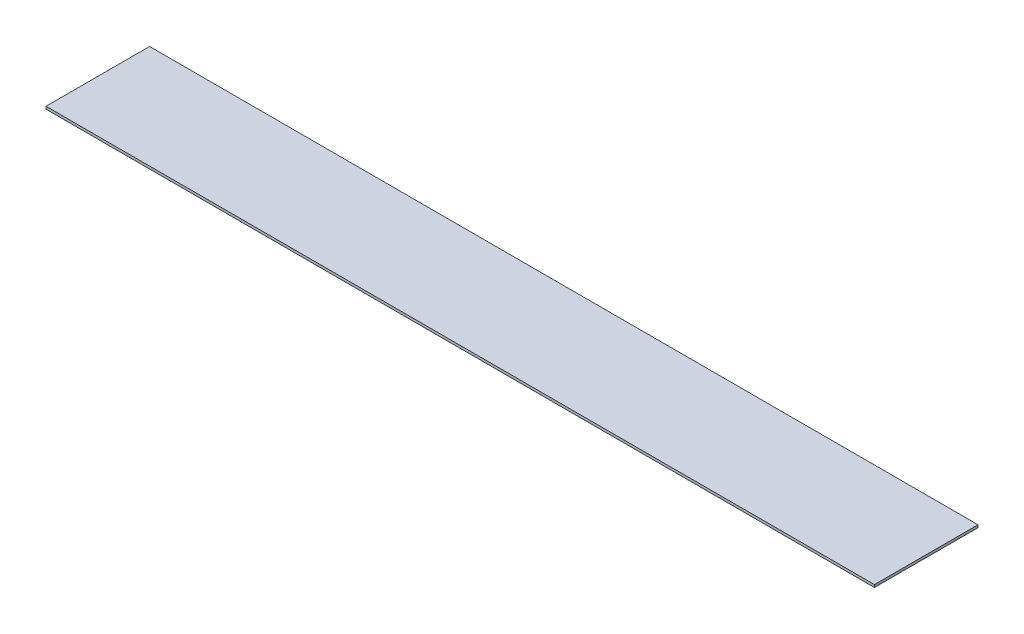
ISO-10303-21;
HEADER;
FILE_DESCRIPTION(('STEP AP214'),'2;1');
FILE_NAME('part.step','',(''),(''),'','','');
FILE_SCHEMA(('AUTOMOTIVE_DESIGN { 1 0 10303 214 1 1 1 1 }'));
ENDSEC;
DATA;
#1=APPLICATION_CONTEXT('core data for automotive mechanical design processes');
#2=APPLICATION_PROTOCOL_DEFINITION('international standard','automotive_design',2000,#1);
#3=PRODUCT_CONTEXT('',#1,'mechanical');
#4=PRODUCT('Part','Part','',(#3));
#5=PRODUCT_RELATED_PRODUCT_CATEGORY('part','',(#4));
#6=PRODUCT_DEFINITION_FORMATION('','',#4);
#7=PRODUCT_DEFINITION_CONTEXT('part definition',#1,'design');
#8=PRODUCT_DEFINITION('design','',#6,#7);
#9=PRODUCT_DEFINITION_SHAPE('','',#8);
#10=(LENGTH_UNIT() NAMED_UNIT(*) SI_UNIT(.MILLI.,.METRE.));
#11=(NAMED_UNIT(*) PLANE_ANGLE_UNIT() SI_UNIT($,.RADIAN.));
#12=(NAMED_UNIT(*) SI_UNIT($,.STERADIAN.) SOLID_ANGLE_UNIT());
#13=UNCERTAINTY_MEASURE_WITH_UNIT(LENGTH_MEASURE(1.E-05),#10,'distance_accuracy_value','');
#14=(GEOMETRIC_REPRESENTATION_CONTEXT(3) GLOBAL_UNCERTAINTY_ASSIGNED_CONTEXT((#13)) GLOBAL_UNIT_ASSIGNED_CONTEXT((#10,
#11,#12)) REPRESENTATION_CONTEXT('',''));
#15=CARTESIAN_POINT('',(0.,0.,0.));
#16=DIRECTION('',(0.,0.,1.));
#17=DIRECTION('',(1.,0.,0.));
#18=AXIS2_PLACEMENT_3D('',#15,#16,#17);
#19=CARTESIAN_POINT('',(0.,1.27,0.));
#20=DIRECTION('',(1.,0.,0.));
#21=DIRECTION('',(0.,0.,-1.));
#22=AXIS2_PLACEMENT_3D('',#19,#20,#21);
#23=PLANE('',#22);
#24=DIRECTION('',(0.,0.,1.));
#25=VECTOR('',#24,1.);
#26=CARTESIAN_POINT('',(0.,0.,0.));
#27=LINE('',#26,#25);
#28=CARTESIAN_POINT('',(0.,0.,-50.8));
#29=VERTEX_POINT('',#28);
#30=CARTESIAN_POINT('',(0.,0.,0.));
#31=VERTEX_POINT('',#30);
#32=EDGE_CURVE('E95',#29,#31,#27,.T.);
#33=ORIENTED_EDGE('',*,*,#32,.T.);
#34=DIRECTION('',(0.,-1.,0.));
#35=VECTOR('',#34,1.);
#36=CARTESIAN_POINT('',(0.,1.27,0.));
#37=LINE('',#36,#35);
#38=CARTESIAN_POINT('',(0.,1.27,0.));
#39=VERTEX_POINT('',#38);
#40=EDGE_CURVE('E11',#39,#31,#37,.T.);
#41=ORIENTED_EDGE('',*,*,#40,.F.);
#42=DIRECTION('',(0.,0.,1.));
#43=VECTOR('',#42,1.);
#44=CARTESIAN_POINT('',(0.,1.27,0.));
#45=LINE('',#44,#43);
#46=CARTESIAN_POINT('',(0.,1.27,-50.8));
#47=VERTEX_POINT('',#46);
#48=EDGE_CURVE('E83',#47,#39,#45,.T.);
#49=ORIENTED_EDGE('',*,*,#48,.F.);
#50=DIRECTION('',(0.,-1.,0.));
#51=VECTOR('',#50,1.);
#52=CARTESIAN_POINT('',(0.,1.27,-50.8));
#53=LINE('',#52,#51);
#54=EDGE_CURVE('E91',#47,#29,#53,.T.);
#55=ORIENTED_EDGE('',*,*,#54,.T.);
#56=EDGE_LOOP('',(#33,#41,#49,#55));
#57=FACE_BOUND('',#56,.T.);
#58=ADVANCED_FACE('F32',(#57),#23,.F.);
#59=CARTESIAN_POINT('',(0.,1.27,0.));
#60=DIRECTION('',(0.,0.,-1.));
#61=DIRECTION('',(-1.,0.,0.));
#62=AXIS2_PLACEMENT_3D('',#59,#60,#61);
#63=PLANE('',#62);
#64=DIRECTION('',(1.,0.,0.));
#65=VECTOR('',#64,1.);
#66=CARTESIAN_POINT('',(0.,0.,0.));
#67=LINE('',#66,#65);
#68=CARTESIAN_POINT('',(406.4,0.,0.));
#69=VERTEX_POINT('',#68);
#70=EDGE_CURVE('E87',#31,#69,#67,.T.);
#71=ORIENTED_EDGE('',*,*,#70,.T.);
#72=DIRECTION('',(0.,-1.,0.));
#73=VECTOR('',#72,1.);
#74=CARTESIAN_POINT('',(406.4,1.27,0.));
#75=LINE('',#74,#73);
#76=CARTESIAN_POINT('',(406.4,1.27,0.));
#77=VERTEX_POINT('',#76);
#78=EDGE_CURVE('E40',#77,#69,#75,.T.);
#79=ORIENTED_EDGE('',*,*,#78,.F.);
#80=DIRECTION('',(1.,0.,0.));
#81=VECTOR('',#80,1.);
#82=CARTESIAN_POINT('',(0.,1.27,0.));
#83=LINE('',#82,#81);
#84=EDGE_CURVE('E78',#39,#77,#83,.T.);
#85=ORIENTED_EDGE('',*,*,#84,.F.);
#86=ORIENTED_EDGE('',*,*,#40,.T.);
#87=EDGE_LOOP('',(#71,#79,#85,#86));
#88=FACE_BOUND('',#87,.T.);
#89=ADVANCED_FACE('F86',(#88),#63,.F.);
#90=CARTESIAN_POINT('',(406.4,1.27,0.));
#91=DIRECTION('',(-1.,0.,0.));
#92=DIRECTION('',(0.,0.,1.));
#93=AXIS2_PLACEMENT_3D('',#90,#91,#92);
#94=PLANE('',#93);
#95=DIRECTION('',(0.,0.,-1.));
#96=VECTOR('',#95,1.);
#97=CARTESIAN_POINT('',(406.4,0.,0.));
#98=LINE('',#97,#96);
#99=CARTESIAN_POINT('',(406.4,0.,-50.8));
#100=VERTEX_POINT('',#99);
#101=EDGE_CURVE('E65',#69,#100,#98,.T.);
#102=ORIENTED_EDGE('',*,*,#101,.T.);
#103=DIRECTION('',(0.,-1.,0.));
#104=VECTOR('',#103,1.);
#105=CARTESIAN_POINT('',(406.4,1.27,-50.8));
#106=LINE('',#105,#104);
#107=CARTESIAN_POINT('',(406.4,1.27,-50.8));
#108=VERTEX_POINT('',#107);
#109=EDGE_CURVE('E88',#108,#100,#106,.T.);
#110=ORIENTED_EDGE('',*,*,#109,.F.);
#111=DIRECTION('',(0.,0.,-1.));
#112=VECTOR('',#111,1.);
#113=CARTESIAN_POINT('',(406.4,1.27,0.));
#114=LINE('',#113,#112);
#115=EDGE_CURVE('E81',#77,#108,#114,.T.);
#116=ORIENTED_EDGE('',*,*,#115,.F.);
#117=ORIENTED_EDGE('',*,*,#78,.T.);
#118=EDGE_LOOP('',(#102,#110,#116,#117));
#119=FACE_BOUND('',#118,.T.);
#120=ADVANCED_FACE('F89',(#119),#94,.F.);
#121=CARTESIAN_POINT('',(0.,1.27,-50.8));
#122=DIRECTION('',(0.,0.,1.));
#123=DIRECTION('',(1.,0.,0.));
#124=AXIS2_PLACEMENT_3D('',#121,#122,#123);
#125=PLANE('',#124);
#126=DIRECTION('',(-1.,0.,0.));
#127=VECTOR('',#126,1.);
#128=CARTESIAN_POINT('',(0.,0.,-50.8));
#129=LINE('',#128,#127);
#130=EDGE_CURVE('E71',#100,#29,#129,.T.);
#131=ORIENTED_EDGE('',*,*,#130,.T.);
#132=ORIENTED_EDGE('',*,*,#54,.F.);
#133=DIRECTION('',(-1.,0.,0.));
#134=VECTOR('',#133,1.);
#135=CARTESIAN_POINT('',(0.,1.27,-50.8));
#136=LINE('',#135,#134);
#137=EDGE_CURVE('E48',#108,#47,#136,.T.);
#138=ORIENTED_EDGE('',*,*,#137,.F.);
#139=ORIENTED_EDGE('',*,*,#109,.T.);
#140=EDGE_LOOP('',(#131,#132,#138,#139));
#141=FACE_BOUND('',#140,.T.);
#142=ADVANCED_FACE('F102',(#141),#125,.F.);
#143=CARTESIAN_POINT('',(0.,1.27,0.));
#144=DIRECTION('',(0.,-1.,0.));
#145=DIRECTION('',(0.,0.,-1.));
#146=AXIS2_PLACEMENT_3D('',#143,#144,#145);
#147=PLANE('',#146);
#148=ORIENTED_EDGE('',*,*,#48,.T.);
#149=ORIENTED_EDGE('',*,*,#84,.T.);
#150=ORIENTED_EDGE('',*,*,#115,.T.);
#151=ORIENTED_EDGE('',*,*,#137,.T.);
#152=EDGE_LOOP('',(#148,#149,#150,#151));
#153=FACE_BOUND('',#152,.T.);
#154=ADVANCED_FACE('F79',(#153),#147,.F.);
#155=CARTESIAN_POINT('',(0.,0.,0.));
#156=DIRECTION('',(0.,-1.,0.));
#157=DIRECTION('',(0.,0.,-1.));
#158=AXIS2_PLACEMENT_3D('',#155,#156,#157);
#159=PLANE('',#158);
#160=ORIENTED_EDGE('',*,*,#32,.F.);
#161=ORIENTED_EDGE('',*,*,#130,.F.);
#162=ORIENTED_EDGE('',*,*,#101,.F.);
#163=ORIENTED_EDGE('',*,*,#70,.F.);
#164=EDGE_LOOP('',(#160,#161,#162,#163));
#165=FACE_BOUND('',#164,.T.);
#166=ADVANCED_FACE('F105',(#165),#159,.T.);
#167=CLOSED_SHELL('',(#58,#89,#120,#142,#154,#166));
#168=MANIFOLD_SOLID_BREP('B2',#167);
#169=ADVANCED_BREP_SHAPE_REPRESENTATION('',(#18,#168),#14);
#170=SHAPE_DEFINITION_REPRESENTATION(#9,#169);
ENDSEC;
END-ISO-10303-21;
